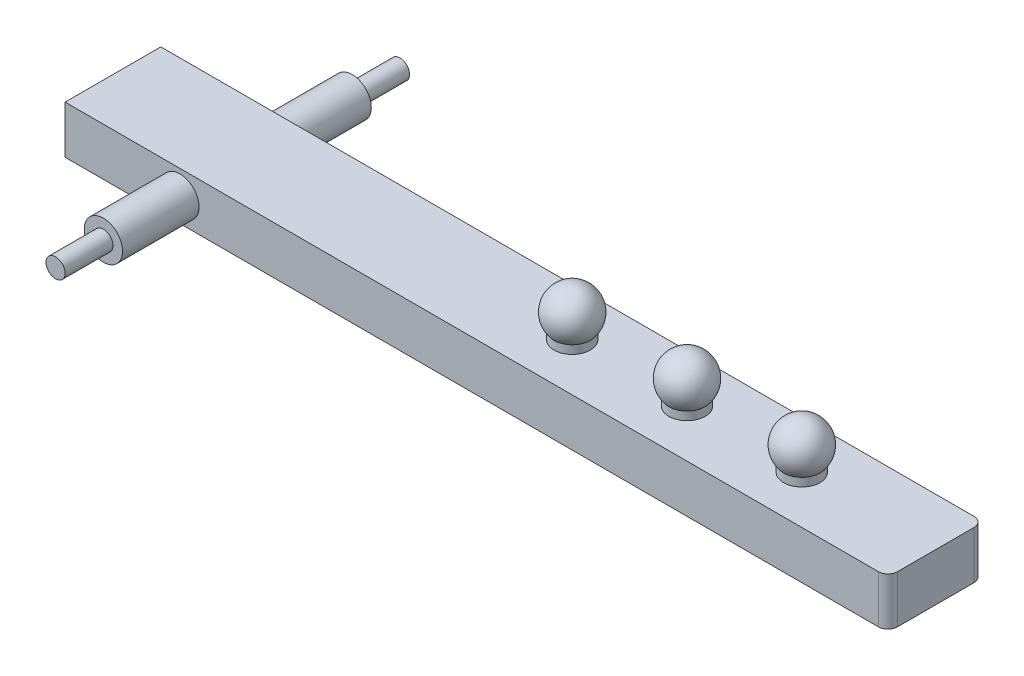
ISO-10303-21;
HEADER;
FILE_DESCRIPTION(('STEP AP214'),'2;1');
FILE_NAME('part.step','',(''),(''),'','','');
FILE_SCHEMA(('AUTOMOTIVE_DESIGN { 1 0 10303 214 1 1 1 1 }'));
ENDSEC;
DATA;
#1=APPLICATION_CONTEXT('core data for automotive mechanical design processes');
#2=APPLICATION_PROTOCOL_DEFINITION('international standard','automotive_design',2000,#1);
#3=PRODUCT_CONTEXT('',#1,'mechanical');
#4=PRODUCT('Part','Part','',(#3));
#5=PRODUCT_RELATED_PRODUCT_CATEGORY('part','',(#4));
#6=PRODUCT_DEFINITION_FORMATION('','',#4);
#7=PRODUCT_DEFINITION_CONTEXT('part definition',#1,'design');
#8=PRODUCT_DEFINITION('design','',#6,#7);
#9=PRODUCT_DEFINITION_SHAPE('','',#8);
#10=(LENGTH_UNIT() NAMED_UNIT(*) SI_UNIT(.MILLI.,.METRE.));
#11=(NAMED_UNIT(*) PLANE_ANGLE_UNIT() SI_UNIT($,.RADIAN.));
#12=(NAMED_UNIT(*) SI_UNIT($,.STERADIAN.) SOLID_ANGLE_UNIT());
#13=UNCERTAINTY_MEASURE_WITH_UNIT(LENGTH_MEASURE(1.E-05),#10,'distance_accuracy_value','');
#14=(GEOMETRIC_REPRESENTATION_CONTEXT(3) GLOBAL_UNCERTAINTY_ASSIGNED_CONTEXT((#13)) GLOBAL_UNIT_ASSIGNED_CONTEXT((#10,
#11,#12)) REPRESENTATION_CONTEXT('',''));
#15=CARTESIAN_POINT('',(0.,0.,0.));
#16=DIRECTION('',(0.,0.,1.));
#17=DIRECTION('',(1.,0.,0.));
#18=AXIS2_PLACEMENT_3D('',#15,#16,#17);
#19=CARTESIAN_POINT('',(0.,0.,130.));
#20=DIRECTION('',(0.,0.,-1.));
#21=DIRECTION('',(-1.,0.,0.));
#22=AXIS2_PLACEMENT_3D('',#19,#20,#21);
#23=CYLINDRICAL_SURFACE('',#22,20.);
#24=CARTESIAN_POINT('',(0.,0.,50.));
#25=DIRECTION('',(0.,0.,1.));
#26=DIRECTION('',(1.,0.,0.));
#27=AXIS2_PLACEMENT_3D('',#24,#25,#26);
#28=CIRCLE('',#27,20.);
#29=CARTESIAN_POINT('',(20.,0.,50.));
#30=VERTEX_POINT('',#29);
#31=EDGE_CURVE('E112',#30,#30,#28,.T.);
#32=ORIENTED_EDGE('',*,*,#31,.T.);
#33=EDGE_LOOP('',(#32));
#34=FACE_BOUND('',#33,.T.);
#35=CARTESIAN_POINT('',(0.,0.,130.));
#36=DIRECTION('',(0.,0.,1.));
#37=DIRECTION('',(1.,0.,0.));
#38=AXIS2_PLACEMENT_3D('',#35,#36,#37);
#39=CIRCLE('',#38,20.);
#40=CARTESIAN_POINT('',(20.,0.,130.));
#41=VERTEX_POINT('',#40);
#42=EDGE_CURVE('E123',#41,#41,#39,.T.);
#43=ORIENTED_EDGE('',*,*,#42,.F.);
#44=EDGE_LOOP('',(#43));
#45=FACE_BOUND('',#44,.T.);
#46=ADVANCED_FACE('F37',(#34,#45),#23,.T.);
#47=CARTESIAN_POINT('',(0.,0.,130.));
#48=DIRECTION('',(0.,0.,1.));
#49=DIRECTION('',(1.,0.,0.));
#50=AXIS2_PLACEMENT_3D('',#47,#48,#49);
#51=PLANE('',#50);
#52=CARTESIAN_POINT('',(0.,0.,130.));
#53=DIRECTION('',(0.,0.,1.));
#54=DIRECTION('',(1.,0.,0.));
#55=AXIS2_PLACEMENT_3D('',#52,#53,#54);
#56=CIRCLE('',#55,10.);
#57=CARTESIAN_POINT('',(10.,0.,130.));
#58=VERTEX_POINT('',#57);
#59=EDGE_CURVE('E130',#58,#58,#56,.T.);
#60=ORIENTED_EDGE('',*,*,#59,.F.);
#61=EDGE_LOOP('',(#60));
#62=FACE_BOUND('',#61,.T.);
#63=ORIENTED_EDGE('',*,*,#42,.T.);
#64=EDGE_LOOP('',(#63));
#65=FACE_BOUND('',#64,.T.);
#66=ADVANCED_FACE('F177',(#62,#65),#51,.T.);
#67=CARTESIAN_POINT('',(-120.,25.,50.));
#68=DIRECTION('',(1.,0.,0.));
#69=DIRECTION('',(0.,0.,-1.));
#70=AXIS2_PLACEMENT_3D('',#67,#68,#69);
#71=PLANE('',#70);
#72=DIRECTION('',(0.,-1.,0.));
#73=VECTOR('',#72,1.);
#74=CARTESIAN_POINT('',(-120.,25.,-50.));
#75=LINE('',#74,#73);
#76=CARTESIAN_POINT('',(-120.,25.,-50.));
#77=VERTEX_POINT('',#76);
#78=CARTESIAN_POINT('',(-120.,-25.,-50.));
#79=VERTEX_POINT('',#78);
#80=EDGE_CURVE('E111',#77,#79,#75,.T.);
#81=ORIENTED_EDGE('',*,*,#80,.T.);
#82=DIRECTION('',(0.,0.,-1.));
#83=VECTOR('',#82,1.);
#84=CARTESIAN_POINT('',(-120.,-25.,50.));
#85=LINE('',#84,#83);
#86=CARTESIAN_POINT('',(-120.,-25.,50.));
#87=VERTEX_POINT('',#86);
#88=EDGE_CURVE('E94',#87,#79,#85,.T.);
#89=ORIENTED_EDGE('',*,*,#88,.F.);
#90=DIRECTION('',(0.,-1.,0.));
#91=VECTOR('',#90,1.);
#92=CARTESIAN_POINT('',(-120.,25.,50.));
#93=LINE('',#92,#91);
#94=CARTESIAN_POINT('',(-120.,25.,50.));
#95=VERTEX_POINT('',#94);
#96=EDGE_CURVE('E99',#95,#87,#93,.T.);
#97=ORIENTED_EDGE('',*,*,#96,.F.);
#98=DIRECTION('',(0.,0.,-1.));
#99=VECTOR('',#98,1.);
#100=CARTESIAN_POINT('',(-120.,25.,50.));
#101=LINE('',#100,#99);
#102=EDGE_CURVE('E159',#95,#77,#101,.T.);
#103=ORIENTED_EDGE('',*,*,#102,.T.);
#104=EDGE_LOOP('',(#81,#89,#97,#103));
#105=FACE_BOUND('',#104,.T.);
#106=ADVANCED_FACE('F109',(#105),#71,.F.);
#107=CARTESIAN_POINT('',(-120.,-25.,50.));
#108=DIRECTION('',(0.,1.,0.));
#109=DIRECTION('',(0.,0.,1.));
#110=AXIS2_PLACEMENT_3D('',#107,#108,#109);
#111=PLANE('',#110);
#112=DIRECTION('',(1.,0.,0.));
#113=VECTOR('',#112,1.);
#114=CARTESIAN_POINT('',(-120.,-25.,-50.));
#115=LINE('',#114,#113);
#116=CARTESIAN_POINT('',(730.,-25.,-50.));
#117=VERTEX_POINT('',#116);
#118=EDGE_CURVE('E143',#79,#117,#115,.T.);
#119=ORIENTED_EDGE('',*,*,#118,.T.);
#120=CARTESIAN_POINT('',(730.,-25.,-40.));
#121=DIRECTION('',(0.,1.,0.));
#122=DIRECTION('',(0.,0.,1.));
#123=AXIS2_PLACEMENT_3D('',#120,#121,#122);
#124=CIRCLE('',#123,10.);
#125=CARTESIAN_POINT('',(740.,-25.,-40.));
#126=VERTEX_POINT('',#125);
#127=EDGE_CURVE('E45',#117,#126,#124,.F.);
#128=ORIENTED_EDGE('',*,*,#127,.T.);
#129=DIRECTION('',(0.,0.,-1.));
#130=VECTOR('',#129,1.);
#131=CARTESIAN_POINT('',(740.,-25.,50.));
#132=LINE('',#131,#130);
#133=CARTESIAN_POINT('',(740.,-25.,40.));
#134=VERTEX_POINT('',#133);
#135=EDGE_CURVE('E113',#134,#126,#132,.T.);
#136=ORIENTED_EDGE('',*,*,#135,.F.);
#137=CARTESIAN_POINT('',(730.,-25.,40.));
#138=DIRECTION('',(0.,1.,0.));
#139=DIRECTION('',(0.,0.,1.));
#140=AXIS2_PLACEMENT_3D('',#137,#138,#139);
#141=CIRCLE('',#140,10.);
#142=CARTESIAN_POINT('',(730.,-25.,50.));
#143=VERTEX_POINT('',#142);
#144=EDGE_CURVE('E52',#134,#143,#141,.F.);
#145=ORIENTED_EDGE('',*,*,#144,.T.);
#146=DIRECTION('',(1.,0.,0.));
#147=VECTOR('',#146,1.);
#148=CARTESIAN_POINT('',(-120.,-25.,50.));
#149=LINE('',#148,#147);
#150=EDGE_CURVE('E90',#87,#143,#149,.T.);
#151=ORIENTED_EDGE('',*,*,#150,.F.);
#152=ORIENTED_EDGE('',*,*,#88,.T.);
#153=EDGE_LOOP('',(#119,#128,#136,#145,#151,#152));
#154=FACE_BOUND('',#153,.T.);
#155=ADVANCED_FACE('F92',(#154),#111,.F.);
#156=CARTESIAN_POINT('',(740.,25.,50.));
#157=DIRECTION('',(-1.,0.,0.));
#158=DIRECTION('',(0.,0.,1.));
#159=AXIS2_PLACEMENT_3D('',#156,#157,#158);
#160=PLANE('',#159);
#161=ORIENTED_EDGE('',*,*,#135,.T.);
#162=DIRECTION('',(0.,1.,0.));
#163=VECTOR('',#162,1.);
#164=CARTESIAN_POINT('',(740.,25.,-40.));
#165=LINE('',#164,#163);
#166=CARTESIAN_POINT('',(740.,25.,-40.));
#167=VERTEX_POINT('',#166);
#168=EDGE_CURVE('E134',#126,#167,#165,.T.);
#169=ORIENTED_EDGE('',*,*,#168,.T.);
#170=DIRECTION('',(0.,0.,-1.));
#171=VECTOR('',#170,1.);
#172=CARTESIAN_POINT('',(740.,25.,50.));
#173=LINE('',#172,#171);
#174=CARTESIAN_POINT('',(740.,25.,40.));
#175=VERTEX_POINT('',#174);
#176=EDGE_CURVE('E119',#175,#167,#173,.T.);
#177=ORIENTED_EDGE('',*,*,#176,.F.);
#178=DIRECTION('',(0.,1.,0.));
#179=VECTOR('',#178,1.);
#180=CARTESIAN_POINT('',(740.,-25.,40.));
#181=LINE('',#180,#179);
#182=EDGE_CURVE('E132',#175,#134,#181,.F.);
#183=ORIENTED_EDGE('',*,*,#182,.T.);
#184=EDGE_LOOP('',(#161,#169,#177,#183));
#185=FACE_BOUND('',#184,.T.);
#186=ADVANCED_FACE('F147',(#185),#160,.F.);
#187=CARTESIAN_POINT('',(-120.,25.,50.));
#188=DIRECTION('',(0.,-1.,0.));
#189=DIRECTION('',(0.,0.,-1.));
#190=AXIS2_PLACEMENT_3D('',#187,#188,#189);
#191=PLANE('',#190);
#192=CARTESIAN_POINT('',(600.,25.,0.));
#193=DIRECTION('',(0.,-1.,0.));
#194=DIRECTION('',(0.,0.,-1.));
#195=AXIS2_PLACEMENT_3D('',#192,#193,#194);
#196=CIRCLE('',#195,18.9936790671378);
#197=CARTESIAN_POINT('',(600.,25.,-18.9936790671378));
#198=VERTEX_POINT('',#197);
#199=EDGE_CURVE('E403',#198,#198,#196,.T.);
#200=ORIENTED_EDGE('',*,*,#199,.T.);
#201=EDGE_LOOP('',(#200));
#202=FACE_BOUND('',#201,.T.);
#203=CARTESIAN_POINT('',(480.,25.,0.));
#204=DIRECTION('',(0.,-1.,0.));
#205=DIRECTION('',(0.,0.,-1.));
#206=AXIS2_PLACEMENT_3D('',#203,#204,#205);
#207=CIRCLE('',#206,18.9936790671378);
#208=CARTESIAN_POINT('',(480.,25.,-18.9936790671378));
#209=VERTEX_POINT('',#208);
#210=EDGE_CURVE('E395',#209,#209,#207,.T.);
#211=ORIENTED_EDGE('',*,*,#210,.T.);
#212=EDGE_LOOP('',(#211));
#213=FACE_BOUND('',#212,.T.);
#214=CARTESIAN_POINT('',(360.,25.,0.));
#215=DIRECTION('',(0.,-1.,0.));
#216=DIRECTION('',(0.,0.,-1.));
#217=AXIS2_PLACEMENT_3D('',#214,#215,#216);
#218=CIRCLE('',#217,18.9936790671378);
#219=CARTESIAN_POINT('',(360.,25.,-18.9936790671378));
#220=VERTEX_POINT('',#219);
#221=EDGE_CURVE('E388',#220,#220,#218,.T.);
#222=ORIENTED_EDGE('',*,*,#221,.T.);
#223=EDGE_LOOP('',(#222));
#224=FACE_BOUND('',#223,.T.);
#225=ORIENTED_EDGE('',*,*,#176,.T.);
#226=CARTESIAN_POINT('',(730.,25.,-40.));
#227=DIRECTION('',(0.,-1.,0.));
#228=DIRECTION('',(0.,0.,-1.));
#229=AXIS2_PLACEMENT_3D('',#226,#227,#228);
#230=CIRCLE('',#229,10.);
#231=CARTESIAN_POINT('',(730.,25.,-50.));
#232=VERTEX_POINT('',#231);
#233=EDGE_CURVE('E139',#167,#232,#230,.F.);
#234=ORIENTED_EDGE('',*,*,#233,.T.);
#235=DIRECTION('',(-1.,0.,0.));
#236=VECTOR('',#235,1.);
#237=CARTESIAN_POINT('',(-120.,25.,-50.));
#238=LINE('',#237,#236);
#239=EDGE_CURVE('E107',#232,#77,#238,.T.);
#240=ORIENTED_EDGE('',*,*,#239,.T.);
#241=ORIENTED_EDGE('',*,*,#102,.F.);
#242=DIRECTION('',(-1.,0.,0.));
#243=VECTOR('',#242,1.);
#244=CARTESIAN_POINT('',(-120.,25.,50.));
#245=LINE('',#244,#243);
#246=CARTESIAN_POINT('',(730.,25.,50.));
#247=VERTEX_POINT('',#246);
#248=EDGE_CURVE('E98',#247,#95,#245,.T.);
#249=ORIENTED_EDGE('',*,*,#248,.F.);
#250=CARTESIAN_POINT('',(730.,25.,40.));
#251=DIRECTION('',(0.,-1.,0.));
#252=DIRECTION('',(0.,0.,-1.));
#253=AXIS2_PLACEMENT_3D('',#250,#251,#252);
#254=CIRCLE('',#253,10.);
#255=EDGE_CURVE('E137',#247,#175,#254,.F.);
#256=ORIENTED_EDGE('',*,*,#255,.T.);
#257=EDGE_LOOP('',(#225,#234,#240,#241,#249,#256));
#258=FACE_BOUND('',#257,.T.);
#259=ADVANCED_FACE('F153',(#202,#213,#224,#258),#191,.F.);
#260=CARTESIAN_POINT('',(0.,0.,50.));
#261=DIRECTION('',(0.,0.,1.));
#262=DIRECTION('',(1.,0.,0.));
#263=AXIS2_PLACEMENT_3D('',#260,#261,#262);
#264=PLANE('',#263);
#265=ORIENTED_EDGE('',*,*,#31,.F.);
#266=EDGE_LOOP('',(#265));
#267=FACE_BOUND('',#266,.T.);
#268=ORIENTED_EDGE('',*,*,#150,.T.);
#269=DIRECTION('',(0.,1.,0.));
#270=VECTOR('',#269,1.);
#271=CARTESIAN_POINT('',(730.,25.,50.));
#272=LINE('',#271,#270);
#273=EDGE_CURVE('E11',#143,#247,#272,.T.);
#274=ORIENTED_EDGE('',*,*,#273,.T.);
#275=ORIENTED_EDGE('',*,*,#248,.T.);
#276=ORIENTED_EDGE('',*,*,#96,.T.);
#277=EDGE_LOOP('',(#268,#274,#275,#276));
#278=FACE_BOUND('',#277,.T.);
#279=ADVANCED_FACE('F102',(#267,#278),#264,.T.);
#280=CARTESIAN_POINT('',(0.,0.,-50.));
#281=DIRECTION('',(0.,0.,1.));
#282=DIRECTION('',(1.,0.,0.));
#283=AXIS2_PLACEMENT_3D('',#280,#281,#282);
#284=PLANE('',#283);
#285=CARTESIAN_POINT('',(0.,0.,-50.));
#286=DIRECTION('',(0.,0.,1.));
#287=DIRECTION('',(1.,0.,0.));
#288=AXIS2_PLACEMENT_3D('',#285,#286,#287);
#289=CIRCLE('',#288,20.);
#290=CARTESIAN_POINT('',(20.,0.,-50.));
#291=VERTEX_POINT('',#290);
#292=EDGE_CURVE('E126',#291,#291,#289,.T.);
#293=ORIENTED_EDGE('',*,*,#292,.T.);
#294=EDGE_LOOP('',(#293));
#295=FACE_BOUND('',#294,.T.);
#296=ORIENTED_EDGE('',*,*,#239,.F.);
#297=DIRECTION('',(0.,1.,0.));
#298=VECTOR('',#297,1.);
#299=CARTESIAN_POINT('',(730.,0.,-50.));
#300=LINE('',#299,#298);
#301=EDGE_CURVE('E60',#232,#117,#300,.F.);
#302=ORIENTED_EDGE('',*,*,#301,.T.);
#303=ORIENTED_EDGE('',*,*,#118,.F.);
#304=ORIENTED_EDGE('',*,*,#80,.F.);
#305=EDGE_LOOP('',(#296,#302,#303,#304));
#306=FACE_BOUND('',#305,.T.);
#307=ADVANCED_FACE('F154',(#295,#306),#284,.F.);
#308=CARTESIAN_POINT('',(0.,0.,-130.));
#309=DIRECTION('',(0.,0.,1.));
#310=DIRECTION('',(1.,0.,0.));
#311=AXIS2_PLACEMENT_3D('',#308,#309,#310);
#312=PLANE('',#311);
#313=CARTESIAN_POINT('',(0.,0.,-130.));
#314=DIRECTION('',(0.,0.,1.));
#315=DIRECTION('',(1.,0.,0.));
#316=AXIS2_PLACEMENT_3D('',#313,#314,#315);
#317=CIRCLE('',#316,10.);
#318=CARTESIAN_POINT('',(10.,0.,-130.));
#319=VERTEX_POINT('',#318);
#320=EDGE_CURVE('E168',#319,#319,#317,.T.);
#321=ORIENTED_EDGE('',*,*,#320,.T.);
#322=EDGE_LOOP('',(#321));
#323=FACE_BOUND('',#322,.T.);
#324=CARTESIAN_POINT('',(0.,0.,-130.));
#325=DIRECTION('',(0.,0.,1.));
#326=DIRECTION('',(1.,0.,0.));
#327=AXIS2_PLACEMENT_3D('',#324,#325,#326);
#328=CIRCLE('',#327,20.);
#329=CARTESIAN_POINT('',(20.,0.,-130.));
#330=VERTEX_POINT('',#329);
#331=EDGE_CURVE('E116',#330,#330,#328,.T.);
#332=ORIENTED_EDGE('',*,*,#331,.F.);
#333=EDGE_LOOP('',(#332));
#334=FACE_BOUND('',#333,.T.);
#335=ADVANCED_FACE('F191',(#323,#334),#312,.F.);
#336=ORIENTED_EDGE('',*,*,#331,.T.);
#337=EDGE_LOOP('',(#336));
#338=FACE_BOUND('',#337,.T.);
#339=ORIENTED_EDGE('',*,*,#292,.F.);
#340=EDGE_LOOP('',(#339));
#341=FACE_BOUND('',#340,.T.);
#342=ADVANCED_FACE('F186',(#338,#341),#23,.T.);
#343=CARTESIAN_POINT('',(0.,0.,180.));
#344=DIRECTION('',(0.,0.,-1.));
#345=DIRECTION('',(-1.,0.,0.));
#346=AXIS2_PLACEMENT_3D('',#343,#344,#345);
#347=CYLINDRICAL_SURFACE('',#346,10.);
#348=CARTESIAN_POINT('',(0.,0.,180.));
#349=DIRECTION('',(0.,0.,1.));
#350=DIRECTION('',(1.,0.,0.));
#351=AXIS2_PLACEMENT_3D('',#348,#349,#350);
#352=CIRCLE('',#351,10.);
#353=CARTESIAN_POINT('',(10.,0.,180.));
#354=VERTEX_POINT('',#353);
#355=EDGE_CURVE('E161',#354,#354,#352,.T.);
#356=ORIENTED_EDGE('',*,*,#355,.F.);
#357=EDGE_LOOP('',(#356));
#358=FACE_BOUND('',#357,.T.);
#359=ORIENTED_EDGE('',*,*,#59,.T.);
#360=EDGE_LOOP('',(#359));
#361=FACE_BOUND('',#360,.T.);
#362=ADVANCED_FACE('F175',(#358,#361),#347,.T.);
#363=CARTESIAN_POINT('',(0.,0.,180.));
#364=DIRECTION('',(0.,0.,1.));
#365=DIRECTION('',(1.,0.,0.));
#366=AXIS2_PLACEMENT_3D('',#363,#364,#365);
#367=PLANE('',#366);
#368=ORIENTED_EDGE('',*,*,#355,.T.);
#369=EDGE_LOOP('',(#368));
#370=FACE_BOUND('',#369,.T.);
#371=ADVANCED_FACE('F197',(#370),#367,.T.);
#372=CARTESIAN_POINT('',(0.,0.,-180.));
#373=DIRECTION('',(0.,0.,1.));
#374=DIRECTION('',(1.,0.,0.));
#375=AXIS2_PLACEMENT_3D('',#372,#373,#374);
#376=CYLINDRICAL_SURFACE('',#375,10.);
#377=CARTESIAN_POINT('',(0.,0.,-180.));
#378=DIRECTION('',(0.,0.,1.));
#379=DIRECTION('',(1.,0.,0.));
#380=AXIS2_PLACEMENT_3D('',#377,#378,#379);
#381=CIRCLE('',#380,10.);
#382=CARTESIAN_POINT('',(10.,0.,-180.));
#383=VERTEX_POINT('',#382);
#384=EDGE_CURVE('E163',#383,#383,#381,.T.);
#385=ORIENTED_EDGE('',*,*,#384,.T.);
#386=EDGE_LOOP('',(#385));
#387=FACE_BOUND('',#386,.T.);
#388=ORIENTED_EDGE('',*,*,#320,.F.);
#389=EDGE_LOOP('',(#388));
#390=FACE_BOUND('',#389,.T.);
#391=ADVANCED_FACE('F318',(#387,#390),#376,.T.);
#392=CARTESIAN_POINT('',(0.,0.,-180.));
#393=DIRECTION('',(0.,0.,-1.));
#394=DIRECTION('',(1.,0.,0.));
#395=AXIS2_PLACEMENT_3D('',#392,#393,#394);
#396=PLANE('',#395);
#397=ORIENTED_EDGE('',*,*,#384,.F.);
#398=EDGE_LOOP('',(#397));
#399=FACE_BOUND('',#398,.T.);
#400=ADVANCED_FACE('F310',(#399),#396,.T.);
#401=CARTESIAN_POINT('',(360.,25.,0.));
#402=DIRECTION('',(0.,-1.,0.));
#403=DIRECTION('',(0.,0.,-1.));
#404=AXIS2_PLACEMENT_3D('',#401,#402,#403);
#405=CYLINDRICAL_SURFACE('',#404,18.9936790671378);
#406=CARTESIAN_POINT('',(360.,33.7445345961867,0.));
#407=DIRECTION('',(0.,-1.,0.));
#408=DIRECTION('',(0.,0.,-1.));
#409=AXIS2_PLACEMENT_3D('',#406,#407,#408);
#410=CIRCLE('',#409,18.9936790671378);
#411=CARTESIAN_POINT('',(360.,33.7445345961867,-18.9936790671378));
#412=VERTEX_POINT('',#411);
#413=EDGE_CURVE('E390',#412,#412,#410,.T.);
#414=ORIENTED_EDGE('',*,*,#413,.T.);
#415=EDGE_LOOP('',(#414));
#416=FACE_BOUND('',#415,.T.);
#417=ORIENTED_EDGE('',*,*,#221,.F.);
#418=EDGE_LOOP('',(#417));
#419=FACE_BOUND('',#418,.T.);
#420=ADVANCED_FACE('F302',(#416,#419),#405,.T.);
#421=CARTESIAN_POINT('',(360.,50.,0.));
#422=DIRECTION('',(0.,-1.,0.));
#423=DIRECTION('',(1.,0.,0.));
#424=AXIS2_PLACEMENT_3D('',#421,#422,#423);
#425=SPHERICAL_SURFACE('',#424,25.);
#426=ORIENTED_EDGE('',*,*,#413,.F.);
#427=EDGE_LOOP('',(#426));
#428=FACE_BOUND('',#427,.T.);
#429=ADVANCED_FACE('F294',(#428),#425,.T.);
#430=CARTESIAN_POINT('',(480.,25.,0.));
#431=DIRECTION('',(0.,-1.,0.));
#432=DIRECTION('',(0.,0.,-1.));
#433=AXIS2_PLACEMENT_3D('',#430,#431,#432);
#434=CYLINDRICAL_SURFACE('',#433,18.9936790671378);
#435=CARTESIAN_POINT('',(480.,33.7445345961867,0.));
#436=DIRECTION('',(0.,-1.,0.));
#437=DIRECTION('',(0.,0.,-1.));
#438=AXIS2_PLACEMENT_3D('',#435,#436,#437);
#439=CIRCLE('',#438,18.9936790671378);
#440=CARTESIAN_POINT('',(480.,33.7445345961867,-18.9936790671378));
#441=VERTEX_POINT('',#440);
#442=EDGE_CURVE('E400',#441,#441,#439,.T.);
#443=ORIENTED_EDGE('',*,*,#442,.T.);
#444=EDGE_LOOP('',(#443));
#445=FACE_BOUND('',#444,.T.);
#446=ORIENTED_EDGE('',*,*,#210,.F.);
#447=EDGE_LOOP('',(#446));
#448=FACE_BOUND('',#447,.T.);
#449=ADVANCED_FACE('F286',(#445,#448),#434,.T.);
#450=CARTESIAN_POINT('',(480.,50.,0.));
#451=DIRECTION('',(0.,-1.,0.));
#452=DIRECTION('',(1.,0.,0.));
#453=AXIS2_PLACEMENT_3D('',#450,#451,#452);
#454=SPHERICAL_SURFACE('',#453,25.);
#455=ORIENTED_EDGE('',*,*,#442,.F.);
#456=EDGE_LOOP('',(#455));
#457=FACE_BOUND('',#456,.T.);
#458=ADVANCED_FACE('F278',(#457),#454,.T.);
#459=CARTESIAN_POINT('',(600.,25.,0.));
#460=DIRECTION('',(0.,-1.,0.));
#461=DIRECTION('',(0.,0.,-1.));
#462=AXIS2_PLACEMENT_3D('',#459,#460,#461);
#463=CYLINDRICAL_SURFACE('',#462,18.9936790671378);
#464=CARTESIAN_POINT('',(600.,33.7445345961867,0.));
#465=DIRECTION('',(0.,-1.,0.));
#466=DIRECTION('',(0.,0.,-1.));
#467=AXIS2_PLACEMENT_3D('',#464,#465,#466);
#468=CIRCLE('',#467,18.9936790671378);
#469=CARTESIAN_POINT('',(600.,33.7445345961867,-18.9936790671378));
#470=VERTEX_POINT('',#469);
#471=EDGE_CURVE('E406',#470,#470,#468,.T.);
#472=ORIENTED_EDGE('',*,*,#471,.T.);
#473=EDGE_LOOP('',(#472));
#474=FACE_BOUND('',#473,.T.);
#475=ORIENTED_EDGE('',*,*,#199,.F.);
#476=EDGE_LOOP('',(#475));
#477=FACE_BOUND('',#476,.T.);
#478=ADVANCED_FACE('F271',(#474,#477),#463,.T.);
#479=CARTESIAN_POINT('',(600.,50.,0.));
#480=DIRECTION('',(0.,-1.,0.));
#481=DIRECTION('',(1.,0.,0.));
#482=AXIS2_PLACEMENT_3D('',#479,#480,#481);
#483=SPHERICAL_SURFACE('',#482,25.);
#484=ORIENTED_EDGE('',*,*,#471,.F.);
#485=EDGE_LOOP('',(#484));
#486=FACE_BOUND('',#485,.T.);
#487=ADVANCED_FACE('F256',(#486),#483,.T.);
#488=CARTESIAN_POINT('',(730.,25.,-40.));
#489=DIRECTION('',(0.,1.,0.));
#490=DIRECTION('',(0.,0.,1.));
#491=AXIS2_PLACEMENT_3D('',#488,#489,#490);
#492=CYLINDRICAL_SURFACE('',#491,10.);
#493=ORIENTED_EDGE('',*,*,#127,.F.);
#494=ORIENTED_EDGE('',*,*,#301,.F.);
#495=ORIENTED_EDGE('',*,*,#233,.F.);
#496=ORIENTED_EDGE('',*,*,#168,.F.);
#497=EDGE_LOOP('',(#493,#494,#495,#496));
#498=FACE_BOUND('',#497,.T.);
#499=ADVANCED_FACE('F151',(#498),#492,.T.);
#500=CARTESIAN_POINT('',(730.,0.,40.));
#501=DIRECTION('',(0.,-1.,0.));
#502=DIRECTION('',(0.,0.,-1.));
#503=AXIS2_PLACEMENT_3D('',#500,#501,#502);
#504=CYLINDRICAL_SURFACE('',#503,10.);
#505=ORIENTED_EDGE('',*,*,#144,.F.);
#506=ORIENTED_EDGE('',*,*,#182,.F.);
#507=ORIENTED_EDGE('',*,*,#255,.F.);
#508=ORIENTED_EDGE('',*,*,#273,.F.);
#509=EDGE_LOOP('',(#505,#506,#507,#508));
#510=FACE_BOUND('',#509,.T.);
#511=ADVANCED_FACE('F39',(#510),#504,.T.);
#512=CLOSED_SHELL('',(#46,#66,#106,#155,#186,#259,#279,#307,#335,#342,#362,#371,#391,#400,#420,
#429,#449,#458,#478,#487,#499,#511));
#513=MANIFOLD_SOLID_BREP('B2',#512);
#514=ADVANCED_BREP_SHAPE_REPRESENTATION('',(#18,#513),#14);
#515=SHAPE_DEFINITION_REPRESENTATION(#9,#514);
ENDSEC;
END-ISO-10303-21;
